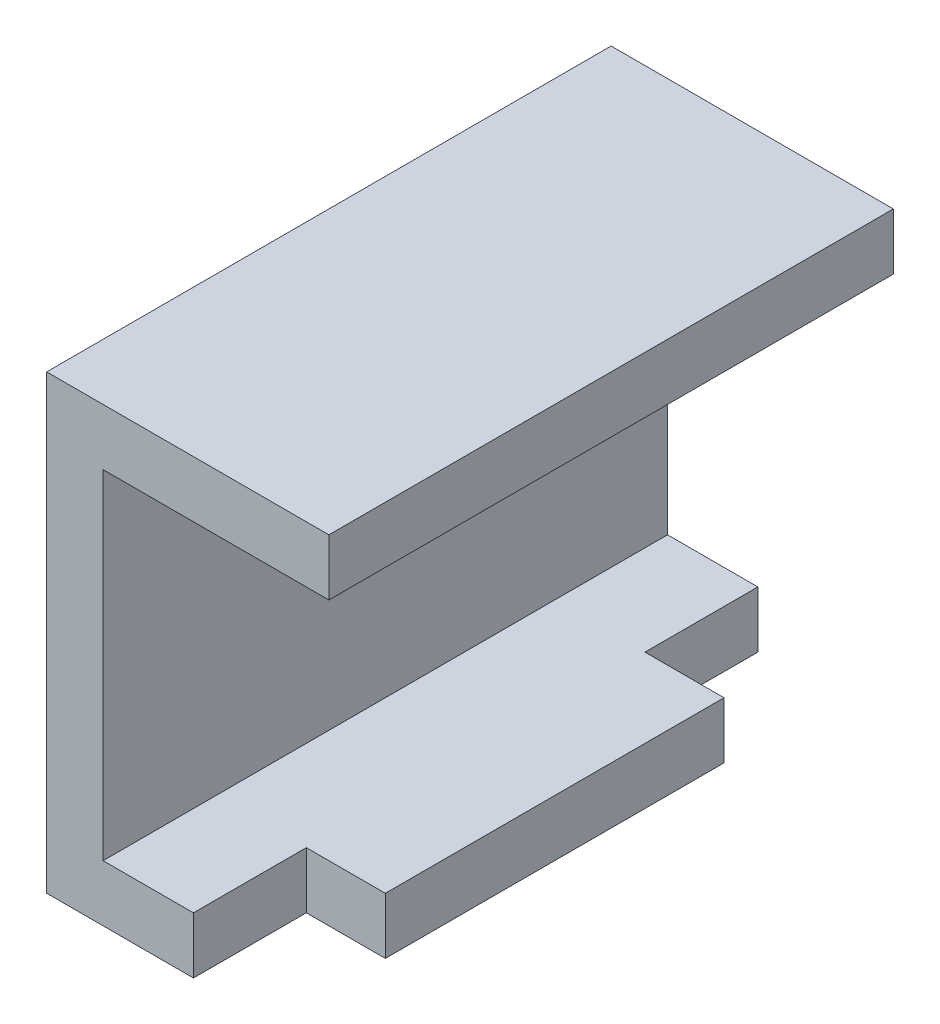
ISO-10303-21;
HEADER;
FILE_DESCRIPTION(('STEP AP214'),'2;1');
FILE_NAME('part.step','',(''),(''),'','','');
FILE_SCHEMA(('AUTOMOTIVE_DESIGN { 1 0 10303 214 1 1 1 1 }'));
ENDSEC;
DATA;
#1=APPLICATION_CONTEXT('core data for automotive mechanical design processes');
#2=APPLICATION_PROTOCOL_DEFINITION('international standard','automotive_design',2000,#1);
#3=PRODUCT_CONTEXT('',#1,'mechanical');
#4=PRODUCT('Part','Part','',(#3));
#5=PRODUCT_RELATED_PRODUCT_CATEGORY('part','',(#4));
#6=PRODUCT_DEFINITION_FORMATION('','',#4);
#7=PRODUCT_DEFINITION_CONTEXT('part definition',#1,'design');
#8=PRODUCT_DEFINITION('design','',#6,#7);
#9=PRODUCT_DEFINITION_SHAPE('','',#8);
#10=(LENGTH_UNIT() NAMED_UNIT(*) SI_UNIT(.MILLI.,.METRE.));
#11=(NAMED_UNIT(*) PLANE_ANGLE_UNIT() SI_UNIT($,.RADIAN.));
#12=(NAMED_UNIT(*) SI_UNIT($,.STERADIAN.) SOLID_ANGLE_UNIT());
#13=UNCERTAINTY_MEASURE_WITH_UNIT(LENGTH_MEASURE(1.E-05),#10,'distance_accuracy_value','');
#14=(GEOMETRIC_REPRESENTATION_CONTEXT(3) GLOBAL_UNCERTAINTY_ASSIGNED_CONTEXT((#13)) GLOBAL_UNIT_ASSIGNED_CONTEXT((#10,
#11,#12)) REPRESENTATION_CONTEXT('',''));
#15=CARTESIAN_POINT('',(0.,0.,0.));
#16=DIRECTION('',(0.,0.,1.));
#17=DIRECTION('',(1.,0.,0.));
#18=AXIS2_PLACEMENT_3D('',#15,#16,#17);
#19=CARTESIAN_POINT('',(0.01333332782721,0.,0.4));
#20=DIRECTION('',(0.,0.,-1.));
#21=DIRECTION('',(0.,-1.,0.));
#22=AXIS2_PLACEMENT_3D('',#19,#20,#21);
#23=PLANE('',#22);
#24=DIRECTION('',(1.,0.,0.));
#25=VECTOR('',#24,1.);
#26=CARTESIAN_POINT('',(0.01333332782721,0.05,0.4));
#27=LINE('',#26,#25);
#28=CARTESIAN_POINT('',(-0.05666667217279,0.05,0.4));
#29=VERTEX_POINT('',#28);
#30=CARTESIAN_POINT('',(0.01333332782721,0.05,0.4));
#31=VERTEX_POINT('',#30);
#32=EDGE_CURVE('E41',#29,#31,#27,.T.);
#33=ORIENTED_EDGE('',*,*,#32,.F.);
#34=DIRECTION('',(0.,1.,0.));
#35=VECTOR('',#34,1.);
#36=CARTESIAN_POINT('',(-0.05666667217279,0.,0.4));
#37=LINE('',#36,#35);
#38=CARTESIAN_POINT('',(-0.05666667217279,0.,0.4));
#39=VERTEX_POINT('',#38);
#40=EDGE_CURVE('E11',#39,#29,#37,.T.);
#41=ORIENTED_EDGE('',*,*,#40,.F.);
#42=DIRECTION('',(-1.,0.,0.));
#43=VECTOR('',#42,1.);
#44=CARTESIAN_POINT('',(-0.08666667217279,0.,0.4));
#45=LINE('',#44,#43);
#46=CARTESIAN_POINT('',(0.01333332782721,0.,0.4));
#47=VERTEX_POINT('',#46);
#48=EDGE_CURVE('E172',#47,#39,#45,.T.);
#49=ORIENTED_EDGE('',*,*,#48,.F.);
#50=DIRECTION('',(0.,-1.,0.));
#51=VECTOR('',#50,1.);
#52=CARTESIAN_POINT('',(0.01333332782721,0.,0.4));
#53=LINE('',#52,#51);
#54=EDGE_CURVE('E177',#31,#47,#53,.T.);
#55=ORIENTED_EDGE('',*,*,#54,.F.);
#56=EDGE_LOOP('',(#33,#41,#49,#55));
#57=FACE_BOUND('',#56,.T.);
#58=ADVANCED_FACE('F16',(#57),#23,.F.);
#59=CARTESIAN_POINT('',(-0.05666667217279,0.,0.4));
#60=DIRECTION('',(-1.,0.,0.));
#61=DIRECTION('',(0.,1.,0.));
#62=AXIS2_PLACEMENT_3D('',#59,#60,#61);
#63=PLANE('',#62);
#64=DIRECTION('',(0.,0.,-1.));
#65=VECTOR('',#64,1.);
#66=CARTESIAN_POINT('',(-0.05666667217279,0.05,0.2));
#67=LINE('',#66,#65);
#68=CARTESIAN_POINT('',(-0.05666667217279,0.05,0.5));
#69=VERTEX_POINT('',#68);
#70=EDGE_CURVE('E165',#69,#29,#67,.T.);
#71=ORIENTED_EDGE('',*,*,#70,.F.);
#72=DIRECTION('',(0.,1.,0.));
#73=VECTOR('',#72,1.);
#74=CARTESIAN_POINT('',(-0.05666667217279,0.10546875,0.5));
#75=LINE('',#74,#73);
#76=CARTESIAN_POINT('',(-0.05666667217279,0.,0.5));
#77=VERTEX_POINT('',#76);
#78=EDGE_CURVE('E200',#77,#69,#75,.T.);
#79=ORIENTED_EDGE('',*,*,#78,.F.);
#80=DIRECTION('',(0.,0.,1.));
#81=VECTOR('',#80,1.);
#82=CARTESIAN_POINT('',(-0.05666667217279,0.,0.2));
#83=LINE('',#82,#81);
#84=EDGE_CURVE('E168',#39,#77,#83,.T.);
#85=ORIENTED_EDGE('',*,*,#84,.F.);
#86=ORIENTED_EDGE('',*,*,#40,.T.);
#87=EDGE_LOOP('',(#71,#79,#85,#86));
#88=FACE_BOUND('',#87,.T.);
#89=ADVANCED_FACE('F417',(#88),#63,.F.);
#90=CARTESIAN_POINT('',(-0.05666667217279,0.,0.1));
#91=DIRECTION('',(0.,0.,1.));
#92=DIRECTION('',(1.,0.,0.));
#93=AXIS2_PLACEMENT_3D('',#90,#91,#92);
#94=PLANE('',#93);
#95=DIRECTION('',(-1.,0.,0.));
#96=VECTOR('',#95,1.);
#97=CARTESIAN_POINT('',(-0.02166667217279,0.05,0.1));
#98=LINE('',#97,#96);
#99=CARTESIAN_POINT('',(0.01333332782721,0.05,0.1));
#100=VERTEX_POINT('',#99);
#101=CARTESIAN_POINT('',(-0.05666667217279,0.05,0.1));
#102=VERTEX_POINT('',#101);
#103=EDGE_CURVE('E186',#100,#102,#98,.T.);
#104=ORIENTED_EDGE('',*,*,#103,.F.);
#105=DIRECTION('',(0.,1.,0.));
#106=VECTOR('',#105,1.);
#107=CARTESIAN_POINT('',(0.01333332782721,0.,0.1));
#108=LINE('',#107,#106);
#109=CARTESIAN_POINT('',(0.01333332782721,0.,0.1));
#110=VERTEX_POINT('',#109);
#111=EDGE_CURVE('E173',#110,#100,#108,.T.);
#112=ORIENTED_EDGE('',*,*,#111,.F.);
#113=DIRECTION('',(1.,0.,0.));
#114=VECTOR('',#113,1.);
#115=CARTESIAN_POINT('',(-0.121666672173,0.,0.1));
#116=LINE('',#115,#114);
#117=CARTESIAN_POINT('',(-0.05666667217279,0.,0.1));
#118=VERTEX_POINT('',#117);
#119=EDGE_CURVE('E156',#118,#110,#116,.T.);
#120=ORIENTED_EDGE('',*,*,#119,.F.);
#121=DIRECTION('',(0.,1.,0.));
#122=VECTOR('',#121,1.);
#123=CARTESIAN_POINT('',(-0.05666667217279,0.,0.1));
#124=LINE('',#123,#122);
#125=EDGE_CURVE('E27',#118,#102,#124,.T.);
#126=ORIENTED_EDGE('',*,*,#125,.T.);
#127=EDGE_LOOP('',(#104,#112,#120,#126));
#128=FACE_BOUND('',#127,.T.);
#129=ADVANCED_FACE('F284',(#128),#94,.F.);
#130=CARTESIAN_POINT('',(-0.05666667217279,0.,0.));
#131=DIRECTION('',(-1.,0.,0.));
#132=DIRECTION('',(0.,1.,0.));
#133=AXIS2_PLACEMENT_3D('',#130,#131,#132);
#134=PLANE('',#133);
#135=DIRECTION('',(0.,0.,-1.));
#136=VECTOR('',#135,1.);
#137=CARTESIAN_POINT('',(-0.05666667217279,0.05,0.));
#138=LINE('',#137,#136);
#139=CARTESIAN_POINT('',(-0.05666667217279,0.05,0.));
#140=VERTEX_POINT('',#139);
#141=EDGE_CURVE('E182',#102,#140,#138,.T.);
#142=ORIENTED_EDGE('',*,*,#141,.F.);
#143=ORIENTED_EDGE('',*,*,#125,.F.);
#144=DIRECTION('',(0.,0.,1.));
#145=VECTOR('',#144,1.);
#146=CARTESIAN_POINT('',(-0.05666667217279,0.,0.));
#147=LINE('',#146,#145);
#148=CARTESIAN_POINT('',(-0.05666667217279,0.,0.));
#149=VERTEX_POINT('',#148);
#150=EDGE_CURVE('E151',#149,#118,#147,.T.);
#151=ORIENTED_EDGE('',*,*,#150,.F.);
#152=DIRECTION('',(0.,-1.,0.));
#153=VECTOR('',#152,1.);
#154=CARTESIAN_POINT('',(-0.05666667217279,0.10546875,0.));
#155=LINE('',#154,#153);
#156=EDGE_CURVE('E178',#140,#149,#155,.T.);
#157=ORIENTED_EDGE('',*,*,#156,.F.);
#158=EDGE_LOOP('',(#142,#143,#151,#157));
#159=FACE_BOUND('',#158,.T.);
#160=ADVANCED_FACE('F288',(#159),#134,.F.);
#161=CARTESIAN_POINT('',(-0.186666672173,0.,0.));
#162=DIRECTION('',(0.,-1.,0.));
#163=DIRECTION('',(0.,0.,-1.));
#164=AXIS2_PLACEMENT_3D('',#161,#162,#163);
#165=PLANE('',#164);
#166=ORIENTED_EDGE('',*,*,#48,.T.);
#167=ORIENTED_EDGE('',*,*,#84,.T.);
#168=DIRECTION('',(1.,0.,0.));
#169=VECTOR('',#168,1.);
#170=CARTESIAN_POINT('',(-0.186666672173,0.,0.5));
#171=LINE('',#170,#169);
#172=CARTESIAN_POINT('',(-0.186666672173,0.,0.5));
#173=VERTEX_POINT('',#172);
#174=EDGE_CURVE('E180',#173,#77,#171,.T.);
#175=ORIENTED_EDGE('',*,*,#174,.F.);
#176=DIRECTION('',(0.,0.,1.));
#177=VECTOR('',#176,1.);
#178=CARTESIAN_POINT('',(-0.186666672173,0.,0.));
#179=LINE('',#178,#177);
#180=CARTESIAN_POINT('',(-0.186666672173,0.,0.));
#181=VERTEX_POINT('',#180);
#182=EDGE_CURVE('E190',#181,#173,#179,.T.);
#183=ORIENTED_EDGE('',*,*,#182,.F.);
#184=DIRECTION('',(1.,0.,0.));
#185=VECTOR('',#184,1.);
#186=CARTESIAN_POINT('',(-0.186666672173,0.,0.));
#187=LINE('',#186,#185);
#188=EDGE_CURVE('E155',#181,#149,#187,.T.);
#189=ORIENTED_EDGE('',*,*,#188,.T.);
#190=ORIENTED_EDGE('',*,*,#150,.T.);
#191=ORIENTED_EDGE('',*,*,#119,.T.);
#192=DIRECTION('',(0.,0.,1.));
#193=VECTOR('',#192,1.);
#194=CARTESIAN_POINT('',(0.01333332782721,0.,0.));
#195=LINE('',#194,#193);
#196=EDGE_CURVE('E241',#110,#47,#195,.T.);
#197=ORIENTED_EDGE('',*,*,#196,.T.);
#198=EDGE_LOOP('',(#166,#167,#175,#183,#189,#190,#191,#197));
#199=FACE_BOUND('',#198,.T.);
#200=ADVANCED_FACE('F289',(#199),#165,.T.);
#201=CARTESIAN_POINT('',(0.01333332782721,0.,0.));
#202=DIRECTION('',(1.,0.,0.));
#203=DIRECTION('',(0.,1.,0.));
#204=AXIS2_PLACEMENT_3D('',#201,#202,#203);
#205=PLANE('',#204);
#206=ORIENTED_EDGE('',*,*,#54,.T.);
#207=ORIENTED_EDGE('',*,*,#196,.F.);
#208=ORIENTED_EDGE('',*,*,#111,.T.);
#209=DIRECTION('',(0.,0.,1.));
#210=VECTOR('',#209,1.);
#211=CARTESIAN_POINT('',(0.01333332782721,0.05,0.));
#212=LINE('',#211,#210);
#213=EDGE_CURVE('E123',#100,#31,#212,.T.);
#214=ORIENTED_EDGE('',*,*,#213,.T.);
#215=EDGE_LOOP('',(#206,#207,#208,#214));
#216=FACE_BOUND('',#215,.T.);
#217=ADVANCED_FACE('F389',(#216),#205,.T.);
#218=CARTESIAN_POINT('',(0.06333332782721,0.35,0.));
#219=DIRECTION('',(1.,0.,0.));
#220=DIRECTION('',(0.,1.,0.));
#221=AXIS2_PLACEMENT_3D('',#218,#219,#220);
#222=PLANE('',#221);
#223=DIRECTION('',(0.,1.,0.));
#224=VECTOR('',#223,1.);
#225=CARTESIAN_POINT('',(0.06333332782721,0.35,0.));
#226=LINE('',#225,#224);
#227=CARTESIAN_POINT('',(0.06333332782721,0.35,0.));
#228=VERTEX_POINT('',#227);
#229=CARTESIAN_POINT('',(0.06333332782721,0.4,0.));
#230=VERTEX_POINT('',#229);
#231=EDGE_CURVE('E105',#228,#230,#226,.T.);
#232=ORIENTED_EDGE('',*,*,#231,.T.);
#233=DIRECTION('',(0.,0.,1.));
#234=VECTOR('',#233,1.);
#235=CARTESIAN_POINT('',(0.06333332782721,0.4,0.));
#236=LINE('',#235,#234);
#237=CARTESIAN_POINT('',(0.06333332782721,0.4,0.5));
#238=VERTEX_POINT('',#237);
#239=EDGE_CURVE('E124',#230,#238,#236,.T.);
#240=ORIENTED_EDGE('',*,*,#239,.T.);
#241=DIRECTION('',(0.,1.,0.));
#242=VECTOR('',#241,1.);
#243=CARTESIAN_POINT('',(0.06333332782721,0.35,0.5));
#244=LINE('',#243,#242);
#245=CARTESIAN_POINT('',(0.06333332782721,0.35,0.5));
#246=VERTEX_POINT('',#245);
#247=EDGE_CURVE('E95',#246,#238,#244,.T.);
#248=ORIENTED_EDGE('',*,*,#247,.F.);
#249=DIRECTION('',(0.,0.,1.));
#250=VECTOR('',#249,1.);
#251=CARTESIAN_POINT('',(0.06333332782721,0.35,0.));
#252=LINE('',#251,#250);
#253=EDGE_CURVE('E102',#228,#246,#252,.T.);
#254=ORIENTED_EDGE('',*,*,#253,.F.);
#255=EDGE_LOOP('',(#232,#240,#248,#254));
#256=FACE_BOUND('',#255,.T.);
#257=ADVANCED_FACE('F104',(#256),#222,.T.);
#258=CARTESIAN_POINT('',(-0.136666672173,0.35,0.));
#259=DIRECTION('',(0.,-1.,0.));
#260=DIRECTION('',(0.,0.,-1.));
#261=AXIS2_PLACEMENT_3D('',#258,#259,#260);
#262=PLANE('',#261);
#263=DIRECTION('',(1.,0.,0.));
#264=VECTOR('',#263,1.);
#265=CARTESIAN_POINT('',(-0.136666672173,0.35,0.));
#266=LINE('',#265,#264);
#267=CARTESIAN_POINT('',(-0.136666672173,0.35,0.));
#268=VERTEX_POINT('',#267);
#269=EDGE_CURVE('E20',#268,#228,#266,.T.);
#270=ORIENTED_EDGE('',*,*,#269,.T.);
#271=ORIENTED_EDGE('',*,*,#253,.T.);
#272=DIRECTION('',(1.,0.,0.));
#273=VECTOR('',#272,1.);
#274=CARTESIAN_POINT('',(-0.136666672173,0.35,0.5));
#275=LINE('',#274,#273);
#276=CARTESIAN_POINT('',(-0.136666672173,0.35,0.5));
#277=VERTEX_POINT('',#276);
#278=EDGE_CURVE('E145',#277,#246,#275,.T.);
#279=ORIENTED_EDGE('',*,*,#278,.F.);
#280=DIRECTION('',(0.,0.,1.));
#281=VECTOR('',#280,1.);
#282=CARTESIAN_POINT('',(-0.136666672173,0.35,0.));
#283=LINE('',#282,#281);
#284=EDGE_CURVE('E129',#268,#277,#283,.T.);
#285=ORIENTED_EDGE('',*,*,#284,.F.);
#286=EDGE_LOOP('',(#270,#271,#279,#285));
#287=FACE_BOUND('',#286,.T.);
#288=ADVANCED_FACE('F127',(#287),#262,.T.);
#289=CARTESIAN_POINT('',(-0.136666672173,0.05,0.));
#290=DIRECTION('',(1.,0.,0.));
#291=DIRECTION('',(0.,1.,0.));
#292=AXIS2_PLACEMENT_3D('',#289,#290,#291);
#293=PLANE('',#292);
#294=DIRECTION('',(0.,1.,0.));
#295=VECTOR('',#294,1.);
#296=CARTESIAN_POINT('',(-0.136666672173,0.05,0.));
#297=LINE('',#296,#295);
#298=CARTESIAN_POINT('',(-0.136666672173,0.05,0.));
#299=VERTEX_POINT('',#298);
#300=EDGE_CURVE('E111',#299,#268,#297,.T.);
#301=ORIENTED_EDGE('',*,*,#300,.T.);
#302=ORIENTED_EDGE('',*,*,#284,.T.);
#303=DIRECTION('',(0.,1.,0.));
#304=VECTOR('',#303,1.);
#305=CARTESIAN_POINT('',(-0.136666672173,0.05,0.5));
#306=LINE('',#305,#304);
#307=CARTESIAN_POINT('',(-0.136666672173,0.05,0.5));
#308=VERTEX_POINT('',#307);
#309=EDGE_CURVE('E159',#308,#277,#306,.T.);
#310=ORIENTED_EDGE('',*,*,#309,.F.);
#311=DIRECTION('',(0.,0.,1.));
#312=VECTOR('',#311,1.);
#313=CARTESIAN_POINT('',(-0.136666672173,0.05,0.));
#314=LINE('',#313,#312);
#315=EDGE_CURVE('E160',#299,#308,#314,.T.);
#316=ORIENTED_EDGE('',*,*,#315,.F.);
#317=EDGE_LOOP('',(#301,#302,#310,#316));
#318=FACE_BOUND('',#317,.T.);
#319=ADVANCED_FACE('F407',(#318),#293,.T.);
#320=CARTESIAN_POINT('',(0.01333332782721,0.05,0.));
#321=DIRECTION('',(0.,1.,0.));
#322=DIRECTION('',(1.,0.,0.));
#323=AXIS2_PLACEMENT_3D('',#320,#321,#322);
#324=PLANE('',#323);
#325=ORIENTED_EDGE('',*,*,#32,.T.);
#326=ORIENTED_EDGE('',*,*,#213,.F.);
#327=ORIENTED_EDGE('',*,*,#103,.T.);
#328=ORIENTED_EDGE('',*,*,#141,.T.);
#329=DIRECTION('',(-1.,0.,0.));
#330=VECTOR('',#329,1.);
#331=CARTESIAN_POINT('',(0.01333332782721,0.05,0.));
#332=LINE('',#331,#330);
#333=EDGE_CURVE('E164',#140,#299,#332,.T.);
#334=ORIENTED_EDGE('',*,*,#333,.T.);
#335=ORIENTED_EDGE('',*,*,#315,.T.);
#336=DIRECTION('',(-1.,0.,0.));
#337=VECTOR('',#336,1.);
#338=CARTESIAN_POINT('',(0.01333332782721,0.05,0.5));
#339=LINE('',#338,#337);
#340=EDGE_CURVE('E204',#69,#308,#339,.T.);
#341=ORIENTED_EDGE('',*,*,#340,.F.);
#342=ORIENTED_EDGE('',*,*,#70,.T.);
#343=EDGE_LOOP('',(#325,#326,#327,#328,#334,#335,#341,#342));
#344=FACE_BOUND('',#343,.T.);
#345=ADVANCED_FACE('F253',(#344),#324,.T.);
#346=CARTESIAN_POINT('',(-0.186666672173,0.4,0.));
#347=DIRECTION('',(-1.,0.,0.));
#348=DIRECTION('',(0.,1.,0.));
#349=AXIS2_PLACEMENT_3D('',#346,#347,#348);
#350=PLANE('',#349);
#351=DIRECTION('',(0.,-1.,0.));
#352=VECTOR('',#351,1.);
#353=CARTESIAN_POINT('',(-0.186666672173,0.4,0.));
#354=LINE('',#353,#352);
#355=CARTESIAN_POINT('',(-0.186666672173,0.4,0.));
#356=VERTEX_POINT('',#355);
#357=EDGE_CURVE('E141',#356,#181,#354,.T.);
#358=ORIENTED_EDGE('',*,*,#357,.T.);
#359=ORIENTED_EDGE('',*,*,#182,.T.);
#360=DIRECTION('',(0.,-1.,0.));
#361=VECTOR('',#360,1.);
#362=CARTESIAN_POINT('',(-0.186666672173,0.4,0.5));
#363=LINE('',#362,#361);
#364=CARTESIAN_POINT('',(-0.186666672173,0.4,0.5));
#365=VERTEX_POINT('',#364);
#366=EDGE_CURVE('E150',#365,#173,#363,.T.);
#367=ORIENTED_EDGE('',*,*,#366,.F.);
#368=DIRECTION('',(0.,0.,1.));
#369=VECTOR('',#368,1.);
#370=CARTESIAN_POINT('',(-0.186666672173,0.4,0.));
#371=LINE('',#370,#369);
#372=EDGE_CURVE('E203',#356,#365,#371,.T.);
#373=ORIENTED_EDGE('',*,*,#372,.F.);
#374=EDGE_LOOP('',(#358,#359,#367,#373));
#375=FACE_BOUND('',#374,.T.);
#376=ADVANCED_FACE('F293',(#375),#350,.T.);
#377=CARTESIAN_POINT('',(0.06333332782721,0.4,0.));
#378=DIRECTION('',(0.,1.,0.));
#379=DIRECTION('',(1.,0.,0.));
#380=AXIS2_PLACEMENT_3D('',#377,#378,#379);
#381=PLANE('',#380);
#382=DIRECTION('',(-1.,0.,0.));
#383=VECTOR('',#382,1.);
#384=CARTESIAN_POINT('',(0.06333332782721,0.4,0.));
#385=LINE('',#384,#383);
#386=EDGE_CURVE('E121',#230,#356,#385,.T.);
#387=ORIENTED_EDGE('',*,*,#386,.T.);
#388=ORIENTED_EDGE('',*,*,#372,.T.);
#389=DIRECTION('',(-1.,0.,0.));
#390=VECTOR('',#389,1.);
#391=CARTESIAN_POINT('',(0.06333332782721,0.4,0.5));
#392=LINE('',#391,#390);
#393=EDGE_CURVE('E146',#238,#365,#392,.T.);
#394=ORIENTED_EDGE('',*,*,#393,.F.);
#395=ORIENTED_EDGE('',*,*,#239,.F.);
#396=EDGE_LOOP('',(#387,#388,#394,#395));
#397=FACE_BOUND('',#396,.T.);
#398=ADVANCED_FACE('F430',(#397),#381,.T.);
#399=CARTESIAN_POINT('',(-0.100729172173,0.2109375,0.5));
#400=DIRECTION('',(0.,0.,1.));
#401=DIRECTION('',(1.,0.,0.));
#402=AXIS2_PLACEMENT_3D('',#399,#400,#401);
#403=PLANE('',#402);
#404=ORIENTED_EDGE('',*,*,#78,.T.);
#405=ORIENTED_EDGE('',*,*,#340,.T.);
#406=ORIENTED_EDGE('',*,*,#309,.T.);
#407=ORIENTED_EDGE('',*,*,#278,.T.);
#408=ORIENTED_EDGE('',*,*,#247,.T.);
#409=ORIENTED_EDGE('',*,*,#393,.T.);
#410=ORIENTED_EDGE('',*,*,#366,.T.);
#411=ORIENTED_EDGE('',*,*,#174,.T.);
#412=EDGE_LOOP('',(#404,#405,#406,#407,#408,#409,#410,#411));
#413=FACE_BOUND('',#412,.T.);
#414=ADVANCED_FACE('F18',(#413),#403,.T.);
#415=CARTESIAN_POINT('',(-0.100729172173,0.2109375,0.));
#416=DIRECTION('',(0.,0.,1.));
#417=DIRECTION('',(1.,0.,0.));
#418=AXIS2_PLACEMENT_3D('',#415,#416,#417);
#419=PLANE('',#418);
#420=ORIENTED_EDGE('',*,*,#156,.T.);
#421=ORIENTED_EDGE('',*,*,#188,.F.);
#422=ORIENTED_EDGE('',*,*,#357,.F.);
#423=ORIENTED_EDGE('',*,*,#386,.F.);
#424=ORIENTED_EDGE('',*,*,#231,.F.);
#425=ORIENTED_EDGE('',*,*,#269,.F.);
#426=ORIENTED_EDGE('',*,*,#300,.F.);
#427=ORIENTED_EDGE('',*,*,#333,.F.);
#428=EDGE_LOOP('',(#420,#421,#422,#423,#424,#425,#426,#427));
#429=FACE_BOUND('',#428,.T.);
#430=ADVANCED_FACE('F116',(#429),#419,.F.);
#431=CLOSED_SHELL('',(#58,#89,#129,#160,#200,#217,#257,#288,#319,#345,#376,#398,#414,#430));
#432=MANIFOLD_SOLID_BREP('B1',#431);
#433=ADVANCED_BREP_SHAPE_REPRESENTATION('',(#18,#432),#14);
#434=SHAPE_DEFINITION_REPRESENTATION(#9,#433);
ENDSEC;
END-ISO-10303-21;
